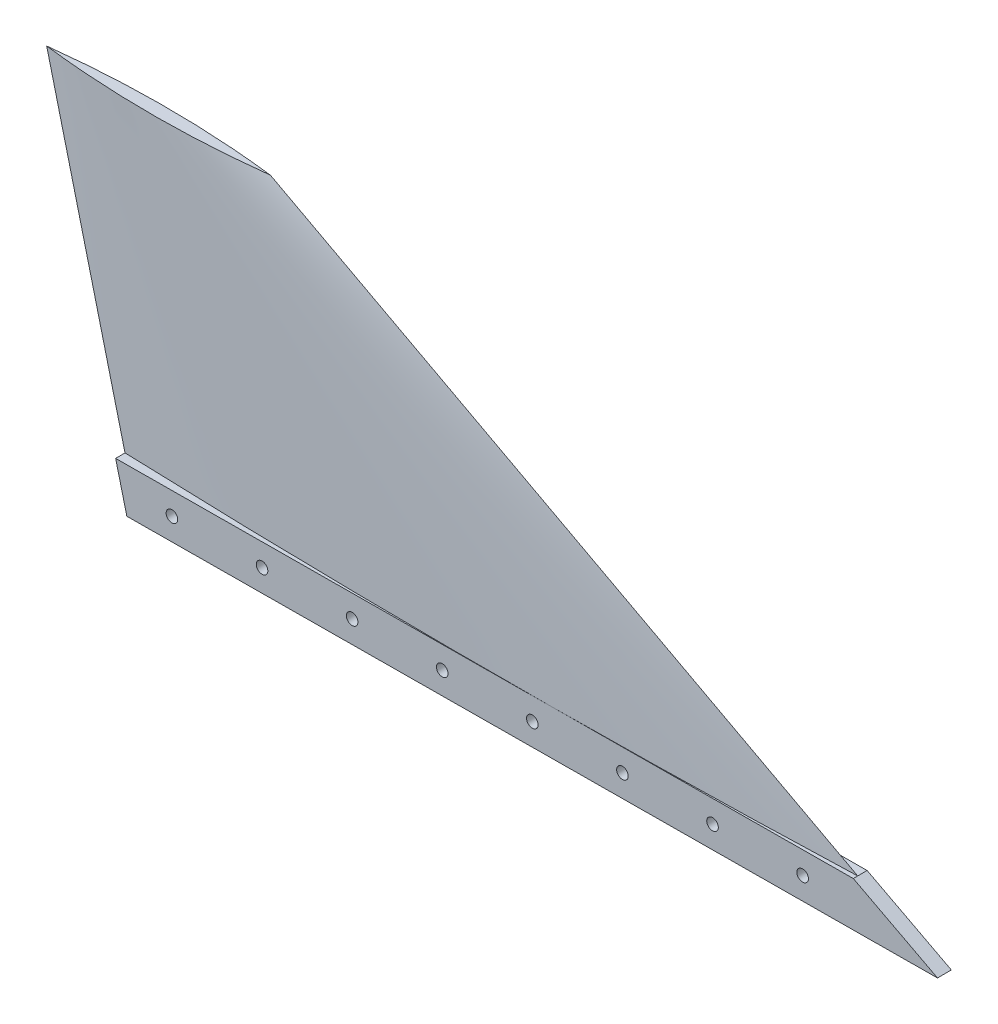
ISO-10303-21;
HEADER;
FILE_DESCRIPTION(('STEP AP214'),'2;1');
FILE_NAME('part.step','',(''),(''),'','','');
FILE_SCHEMA(('AUTOMOTIVE_DESIGN { 1 0 10303 214 1 1 1 1 }'));
ENDSEC;
DATA;
#1=APPLICATION_CONTEXT('core data for automotive mechanical design processes');
#2=APPLICATION_PROTOCOL_DEFINITION('international standard','automotive_design',2000,#1);
#3=PRODUCT_CONTEXT('',#1,'mechanical');
#4=PRODUCT('Part','Part','',(#3));
#5=PRODUCT_RELATED_PRODUCT_CATEGORY('part','',(#4));
#6=PRODUCT_DEFINITION_FORMATION('','',#4);
#7=PRODUCT_DEFINITION_CONTEXT('part definition',#1,'design');
#8=PRODUCT_DEFINITION('design','',#6,#7);
#9=PRODUCT_DEFINITION_SHAPE('','',#8);
#10=(LENGTH_UNIT() NAMED_UNIT(*) SI_UNIT(.MILLI.,.METRE.));
#11=(NAMED_UNIT(*) PLANE_ANGLE_UNIT() SI_UNIT($,.RADIAN.));
#12=(NAMED_UNIT(*) SI_UNIT($,.STERADIAN.) SOLID_ANGLE_UNIT());
#13=UNCERTAINTY_MEASURE_WITH_UNIT(LENGTH_MEASURE(1.E-05),#10,'distance_accuracy_value','');
#14=(GEOMETRIC_REPRESENTATION_CONTEXT(3) GLOBAL_UNCERTAINTY_ASSIGNED_CONTEXT((#13)) GLOBAL_UNIT_ASSIGNED_CONTEXT((#10,
#11,#12)) REPRESENTATION_CONTEXT('',''));
#15=CARTESIAN_POINT('',(0.,0.,0.));
#16=DIRECTION('',(0.,0.,1.));
#17=DIRECTION('',(1.,0.,0.));
#18=AXIS2_PLACEMENT_3D('',#15,#16,#17);
#19=CARTESIAN_POINT('',(0.0361687419159977,0.,5.31354937671676));
#20=DIRECTION('',(0.00680673152056179,0.,0.99997683393467));
#21=DIRECTION('',(0.99997683393467,0.,-0.00680673152056179));
#22=AXIS2_PLACEMENT_3D('',#19,#20,#21);
#23=PLANE('',#22);
#24=DIRECTION('',(-0.99997683393467,0.,0.00680673152056179));
#25=VECTOR('',#24,1.);
#26=CARTESIAN_POINT('',(0.0171196245328655,0.0762000000009213,5.31367904194833));
#27=LINE('',#26,#25);
#28=CARTESIAN_POINT('',(457.072117556768,0.0762000000010352,2.20255630842018));
#29=VERTEX_POINT('',#28);
#30=CARTESIAN_POINT('',(0.0171196245328655,0.0762000000009213,5.31367904194833));
#31=VERTEX_POINT('',#30);
#32=EDGE_CURVE('E104',#29,#31,#27,.T.);
#33=ORIENTED_EDGE('',*,*,#32,.F.);
#34=DIRECTION('',(-0.882327973864772,0.470596722890842,0.00600590876445357));
#35=VECTOR('',#34,1.);
#36=CARTESIAN_POINT('',(409.592192479307,25.3999999999999,2.52574689809315));
#37=LINE('',#36,#35);
#38=CARTESIAN_POINT('',(409.592192479307,25.3999999999999,2.52574689809315));
#39=VERTEX_POINT('',#38);
#40=EDGE_CURVE('E315',#29,#39,#37,.T.);
#41=ORIENTED_EDGE('',*,*,#40,.T.);
#42=DIRECTION('',(-0.99997683393467,0.,0.00680673152056181));
#43=VECTOR('',#42,1.);
#44=CARTESIAN_POINT('',(-6.31353705246148,25.3999999999999,5.35677112057139));
#45=LINE('',#44,#43);
#46=CARTESIAN_POINT('',(240.236539544937,25.3999952591514,3.67853206460334));
#47=VERTEX_POINT('',#46);
#48=EDGE_CURVE('E127',#39,#47,#45,.T.);
#49=ORIENTED_EDGE('',*,*,#48,.T.);
#50=CARTESIAN_POINT('',(-6.31353705246148,25.3999999999999,5.35677112057139));
#51=VERTEX_POINT('',#50);
#52=EDGE_CURVE('E64',#47,#51,#45,.T.);
#53=ORIENTED_EDGE('',*,*,#52,.T.);
#54=DIRECTION('',(0.242524718461399,-0.970143822155345,-0.00165083888910814));
#55=VECTOR('',#54,1.);
#56=CARTESIAN_POINT('',(0.0361687419160004,9.20097331658098E-13,5.31354937671676));
#57=LINE('',#56,#55);
#58=EDGE_CURVE('E118',#51,#31,#57,.T.);
#59=ORIENTED_EDGE('',*,*,#58,.T.);
#60=EDGE_LOOP('',(#33,#41,#49,#53,#59));
#61=FACE_BOUND('',#60,.T.);
#62=CARTESIAN_POINT('',(381.019104809033,12.7,2.72024074023525));
#63=DIRECTION('',(0.00680673152056179,0.,0.99997683393467));
#64=DIRECTION('',(0.99997683393467,0.,-0.00680673152056179));
#65=AXIS2_PLACEMENT_3D('',#62,#63,#64);
#66=CIRCLE('',#65,3.26389999999999);
#67=CARTESIAN_POINT('',(384.282929197312,12.7,2.69802424922529));
#68=VERTEX_POINT('',#67);
#69=EDGE_CURVE('E281',#68,#68,#66,.T.);
#70=ORIENTED_EDGE('',*,*,#69,.F.);
#71=EDGE_LOOP('',(#70));
#72=FACE_BOUND('',#71,.T.);
#73=CARTESIAN_POINT('',(330.221458454008,12.7,3.06601469107229));
#74=DIRECTION('',(0.00680673152056179,0.,0.99997683393467));
#75=DIRECTION('',(0.99997683393467,0.,-0.00680673152056179));
#76=AXIS2_PLACEMENT_3D('',#73,#74,#75);
#77=CIRCLE('',#76,3.26389999999999);
#78=CARTESIAN_POINT('',(333.485282842287,12.7,3.04379820006233));
#79=VERTEX_POINT('',#78);
#80=EDGE_CURVE('E277',#79,#79,#77,.T.);
#81=ORIENTED_EDGE('',*,*,#80,.F.);
#82=EDGE_LOOP('',(#81));
#83=FACE_BOUND('',#82,.T.);
#84=CARTESIAN_POINT('',(279.423812098982,12.7,3.41178864190932));
#85=DIRECTION('',(0.00680673152056179,0.,0.99997683393467));
#86=DIRECTION('',(0.99997683393467,0.,-0.00680673152056179));
#87=AXIS2_PLACEMENT_3D('',#84,#85,#86);
#88=CIRCLE('',#87,3.26389999999999);
#89=CARTESIAN_POINT('',(282.687636487262,12.7,3.38957215089936));
#90=VERTEX_POINT('',#89);
#91=EDGE_CURVE('E272',#90,#90,#88,.T.);
#92=ORIENTED_EDGE('',*,*,#91,.F.);
#93=EDGE_LOOP('',(#92));
#94=FACE_BOUND('',#93,.T.);
#95=CARTESIAN_POINT('',(228.626165743957,12.7,3.75756259274635));
#96=DIRECTION('',(0.00680673152056179,0.,0.99997683393467));
#97=DIRECTION('',(0.99997683393467,0.,-0.00680673152056179));
#98=AXIS2_PLACEMENT_3D('',#95,#96,#97);
#99=CIRCLE('',#98,3.26389999999999);
#100=CARTESIAN_POINT('',(231.889990132237,12.7,3.73534610173639));
#101=VERTEX_POINT('',#100);
#102=EDGE_CURVE('E267',#101,#101,#99,.T.);
#103=ORIENTED_EDGE('',*,*,#102,.F.);
#104=EDGE_LOOP('',(#103));
#105=FACE_BOUND('',#104,.T.);
#106=CARTESIAN_POINT('',(177.828519388932,12.7,4.10333654358339));
#107=DIRECTION('',(0.00680673152056179,0.,0.99997683393467));
#108=DIRECTION('',(0.99997683393467,0.,-0.00680673152056179));
#109=AXIS2_PLACEMENT_3D('',#106,#107,#108);
#110=CIRCLE('',#109,3.26389999999999);
#111=CARTESIAN_POINT('',(181.092343777211,12.7,4.08112005257343));
#112=VERTEX_POINT('',#111);
#113=EDGE_CURVE('E262',#112,#112,#110,.T.);
#114=ORIENTED_EDGE('',*,*,#113,.F.);
#115=EDGE_LOOP('',(#114));
#116=FACE_BOUND('',#115,.T.);
#117=CARTESIAN_POINT('',(127.030873033907,12.7,4.44911049442043));
#118=DIRECTION('',(0.00680673152056179,0.,0.99997683393467));
#119=DIRECTION('',(0.99997683393467,0.,-0.00680673152056179));
#120=AXIS2_PLACEMENT_3D('',#117,#118,#119);
#121=CIRCLE('',#120,3.26389999999999);
#122=CARTESIAN_POINT('',(130.294697422186,12.7,4.42689400341046));
#123=VERTEX_POINT('',#122);
#124=EDGE_CURVE('E257',#123,#123,#121,.T.);
#125=ORIENTED_EDGE('',*,*,#124,.F.);
#126=EDGE_LOOP('',(#125));
#127=FACE_BOUND('',#126,.T.);
#128=CARTESIAN_POINT('',(76.2332266788818,12.7,4.79488444525746));
#129=DIRECTION('',(0.00680673152056179,0.,0.99997683393467));
#130=DIRECTION('',(0.99997683393467,0.,-0.00680673152056179));
#131=AXIS2_PLACEMENT_3D('',#128,#129,#130);
#132=CIRCLE('',#131,3.26389999999999);
#133=CARTESIAN_POINT('',(79.4970510671611,12.7,4.7726679542475));
#134=VERTEX_POINT('',#133);
#135=EDGE_CURVE('E252',#134,#134,#132,.T.);
#136=ORIENTED_EDGE('',*,*,#135,.F.);
#137=EDGE_LOOP('',(#136));
#138=FACE_BOUND('',#137,.T.);
#139=CARTESIAN_POINT('',(25.4355803238566,12.7,5.14065839609449));
#140=DIRECTION('',(0.00680673152056179,0.,0.99997683393467));
#141=DIRECTION('',(0.99997683393467,0.,-0.00680673152056179));
#142=AXIS2_PLACEMENT_3D('',#139,#140,#141);
#143=CIRCLE('',#142,3.26389999999999);
#144=CARTESIAN_POINT('',(28.699404712136,12.7,5.11844190508453));
#145=VERTEX_POINT('',#144);
#146=EDGE_CURVE('E140',#145,#145,#143,.T.);
#147=ORIENTED_EDGE('',*,*,#146,.F.);
#148=EDGE_LOOP('',(#147));
#149=FACE_BOUND('',#148,.T.);
#150=ADVANCED_FACE('F40',(#61,#72,#83,#94,#105,#116,#127,#138,#149),#23,.T.);
#151=CARTESIAN_POINT('',(409.592192479307,25.3999999999999,2.52574689809315));
#152=DIRECTION('',(-0.470585821016415,-0.882348414405783,0.00320322554717418));
#153=DIRECTION('',(0.882352941176471,-0.470588235294116,0.));
#154=AXIS2_PLACEMENT_3D('',#151,#152,#153);
#155=PLANE('',#154);
#156=ORIENTED_EDGE('',*,*,#40,.F.);
#157=DIRECTION('',(-0.00680673152056182,0.,-0.99997683393467));
#158=VECTOR('',#157,1.);
#159=CARTESIAN_POINT('',(457.072117556768,0.0762000000009214,2.20255630842017));
#160=LINE('',#159,#158);
#161=CARTESIAN_POINT('',(457.018462130699,0.0762000000009069,-5.67996159642469));
#162=VERTEX_POINT('',#161);
#163=EDGE_CURVE('E107',#29,#162,#160,.T.);
#164=ORIENTED_EDGE('',*,*,#163,.T.);
#165=DIRECTION('',(-0.882327973864772,0.470596722890842,0.00600590876445357));
#166=VECTOR('',#165,1.);
#167=CARTESIAN_POINT('',(409.538537053238,25.3999999999999,-5.35677100675171));
#168=LINE('',#167,#166);
#169=CARTESIAN_POINT('',(409.538537053238,25.3999999999999,-5.35677100675171));
#170=VERTEX_POINT('',#169);
#171=EDGE_CURVE('E136',#162,#170,#168,.T.);
#172=ORIENTED_EDGE('',*,*,#171,.T.);
#173=DIRECTION('',(-0.00680673152056181,0.,-0.99997683393467));
#174=VECTOR('',#173,1.);
#175=CARTESIAN_POINT('',(409.592192479307,25.3999999999999,2.52574689809315));
#176=LINE('',#175,#174);
#177=CARTESIAN_POINT('',(409.575000000001,25.3999999999999,0.));
#178=VERTEX_POINT('',#177);
#179=EDGE_CURVE('E324',#178,#170,#176,.T.);
#180=ORIENTED_EDGE('',*,*,#179,.F.);
#181=EDGE_CURVE('E153',#39,#178,#176,.T.);
#182=ORIENTED_EDGE('',*,*,#181,.F.);
#183=EDGE_LOOP('',(#156,#164,#172,#180,#182));
#184=FACE_BOUND('',#183,.T.);
#185=ADVANCED_FACE('F179',(#184),#155,.F.);
#186=CARTESIAN_POINT('',(-6.31353705246148,25.3999999999999,5.35677112057139));
#187=DIRECTION('',(0.,-1.,0.));
#188=DIRECTION('',(0.,0.,-1.));
#189=AXIS2_PLACEMENT_3D('',#186,#187,#188);
#190=PLANE('',#189);
#191=CARTESIAN_POINT('',(409.575000000002,25.3999999999999,0.));
#192=CARTESIAN_POINT('',(396.5606245819,25.3999999999999,-0.476916610177097));
#193=CARTESIAN_POINT('',(383.544656897739,25.3999999999999,-0.90907498505507));
#194=CARTESIAN_POINT('',(357.510043009885,25.3999999999999,-1.68386694266647));
#195=CARTESIAN_POINT('',(344.491396803277,25.3999999999999,-2.02650042749993));
#196=CARTESIAN_POINT('',(305.43262135354,25.3999999999999,-2.9200909707166));
#197=CARTESIAN_POINT('',(279.389276173742,25.3999999999999,-3.33675200968741));
#198=CARTESIAN_POINT('',(231.705765832347,25.3999999999999,-3.77142761086389));
#199=CARTESIAN_POINT('',(210.066072612343,25.3999999999999,-3.84495913444976));
#200=CARTESIAN_POINT('',(166.787265614521,25.3999999999999,-3.74439215996127));
#201=CARTESIAN_POINT('',(145.148151835605,25.4,-3.57029417091872));
#202=CARTESIAN_POINT('',(101.862013548756,25.4,-2.97462092692077));
#203=CARTESIAN_POINT('',(80.2149908283904,25.3999999999999,-2.55291618903659));
#204=CARTESIAN_POINT('',(36.9271362679637,25.3999999999999,-1.46203495928207));
#205=CARTESIAN_POINT('',(15.286304441001,25.3999999999999,-0.792857947625323));
#206=CARTESIAN_POINT('',(-6.34999999999872,25.4,0.));
#207=B_SPLINE_CURVE_WITH_KNOTS('',3,(#191,#192,#193,#194,#195,#196,#197,#198,#199,#200,#201,
#202,#203,#204,#205,#206),.UNSPECIFIED.,.F.,.F.,(4,2,2,2,2,2,2,4),(0.,39.0691598923866,
78.1383625086864,156.275629753643,221.193764665568,286.111766130766,351.063745946092,
416.015862186186),.UNSPECIFIED.);
#208=CARTESIAN_POINT('',(163.017578582288,25.3999999999999,-3.67873015464439));
#209=VERTEX_POINT('',#208);
#210=EDGE_CURVE('E189',#178,#209,#207,.T.);
#211=ORIENTED_EDGE('',*,*,#210,.F.);
#212=ORIENTED_EDGE('',*,*,#179,.T.);
#213=DIRECTION('',(-0.99997683393467,0.,0.00680673152056181));
#214=VECTOR('',#213,1.);
#215=CARTESIAN_POINT('',(-6.36719247853088,25.3999999999999,-2.52574678427348));
#216=LINE('',#215,#214);
#217=EDGE_CURVE('E145',#170,#209,#216,.T.);
#218=ORIENTED_EDGE('',*,*,#217,.T.);
#219=EDGE_LOOP('',(#211,#212,#218));
#220=FACE_BOUND('',#219,.T.);
#221=ADVANCED_FACE('F176',(#220),#190,.F.);
#222=CARTESIAN_POINT('',(-6.3499999999997,25.3999999999999,0.));
#223=CARTESIAN_POINT('',(7.31425090283398,25.3999999999999,0.500731518217575));
#224=CARTESIAN_POINT('',(20.980251990129,25.3999999999999,0.952123050195042));
#225=CARTESIAN_POINT('',(48.3151798363333,25.3999999999999,1.7562167474739));
#226=CARTESIAN_POINT('',(61.9841066000349,25.3999999999999,2.10891874985605));
#227=CARTESIAN_POINT('',(102.993810017454,25.3999999999999,3.01896224900369));
#228=CARTESIAN_POINT('',(130.338045274505,25.4,3.42826085952696));
#229=CARTESIAN_POINT('',(178.672798947498,25.3999999999999,3.80242123369392));
#230=CARTESIAN_POINT('',(199.66275311495,25.3999999999999,3.84847649355824));
#231=CARTESIAN_POINT('',(241.641870080202,25.3999999999999,3.70762258713574));
#232=CARTESIAN_POINT('',(262.631032880047,25.4,3.52071407125534));
#233=CARTESIAN_POINT('',(304.616317989458,25.4,2.91406830899902));
#234=CARTESIAN_POINT('',(325.61243863678,25.3999999999999,2.4942164610373));
#235=CARTESIAN_POINT('',(367.598792192431,25.3999999999999,1.42169703584682));
#236=CARTESIAN_POINT('',(388.589025083953,25.3999999999999,0.769028800708385));
#237=CARTESIAN_POINT('',(409.575,25.4,0.));
#238=B_SPLINE_CURVE_WITH_KNOTS('',3,(#222,#223,#224,#225,#226,#227,#228,#229,#230,#231,#232,
#233,#234,#235,#236,#237),.UNSPECIFIED.,.F.,.F.,(4,2,2,2,2,2,2,4),(0.,41.0200628998691,
82.0401935163243,164.078847388457,227.047685887877,290.01634858638,353.01601760556,
416.015864655249),.UNSPECIFIED.);
#239=EDGE_CURVE('E163',#47,#178,#238,.T.);
#240=ORIENTED_EDGE('',*,*,#239,.F.);
#241=ORIENTED_EDGE('',*,*,#48,.F.);
#242=ORIENTED_EDGE('',*,*,#181,.T.);
#243=EDGE_LOOP('',(#240,#241,#242));
#244=FACE_BOUND('',#243,.T.);
#245=ADVANCED_FACE('F330',(#244),#190,.F.);
#246=CARTESIAN_POINT('',(-6.34999999999904,25.4,0.));
#247=VERTEX_POINT('',#246);
#248=EDGE_CURVE('E154',#247,#47,#238,.T.);
#249=ORIENTED_EDGE('',*,*,#248,.F.);
#250=DIRECTION('',(-0.00680673152056181,0.,-0.99997683393467));
#251=VECTOR('',#250,1.);
#252=CARTESIAN_POINT('',(-6.31353705246148,25.3999999999999,5.35677112057139));
#253=LINE('',#252,#251);
#254=EDGE_CURVE('E131',#51,#247,#253,.T.);
#255=ORIENTED_EDGE('',*,*,#254,.F.);
#256=ORIENTED_EDGE('',*,*,#52,.F.);
#257=EDGE_LOOP('',(#249,#255,#256));
#258=FACE_BOUND('',#257,.T.);
#259=ADVANCED_FACE('F177',(#258),#190,.F.);
#260=CARTESIAN_POINT('',(0.0361687419160004,9.20097331658098E-13,5.31354937671676));
#261=DIRECTION('',(0.970121347740181,0.242530336935029,-0.00660350853374309));
#262=DIRECTION('',(-0.242535625036318,0.970142500145336,0.));
#263=AXIS2_PLACEMENT_3D('',#260,#261,#262);
#264=PLANE('',#263);
#265=DIRECTION('',(0.242524718461399,-0.970143822155345,-0.00165083888910814));
#266=VECTOR('',#265,1.);
#267=CARTESIAN_POINT('',(-0.0174866841534056,9.20097331658098E-13,-2.56896852812811));
#268=LINE('',#267,#266);
#269=CARTESIAN_POINT('',(-6.36719247853088,25.3999999999999,-2.52574678427348));
#270=VERTEX_POINT('',#269);
#271=CARTESIAN_POINT('',(-0.0365358015365391,0.0762000000009214,-2.56883886289654));
#272=VERTEX_POINT('',#271);
#273=EDGE_CURVE('E120',#270,#272,#268,.T.);
#274=ORIENTED_EDGE('',*,*,#273,.T.);
#275=DIRECTION('',(0.00680673152056179,0.,0.99997683393467));
#276=VECTOR('',#275,1.);
#277=CARTESIAN_POINT('',(-0.0610759584673629,0.0762000000009214,-6.17403297960506));
#278=LINE('',#277,#276);
#279=EDGE_CURVE('E57',#272,#31,#278,.T.);
#280=ORIENTED_EDGE('',*,*,#279,.T.);
#281=ORIENTED_EDGE('',*,*,#58,.F.);
#282=ORIENTED_EDGE('',*,*,#254,.T.);
#283=EDGE_CURVE('E126',#247,#270,#253,.T.);
#284=ORIENTED_EDGE('',*,*,#283,.T.);
#285=EDGE_LOOP('',(#274,#280,#281,#282,#284));
#286=FACE_BOUND('',#285,.T.);
#287=ADVANCED_FACE('F116',(#286),#264,.F.);
#288=CARTESIAN_POINT('',(162.959355266017,25.3999999999999,-3.67833383498113));
#289=VERTEX_POINT('',#288);
#290=EDGE_CURVE('E50',#289,#247,#207,.T.);
#291=ORIENTED_EDGE('',*,*,#290,.F.);
#292=EDGE_CURVE('E139',#289,#270,#216,.T.);
#293=ORIENTED_EDGE('',*,*,#292,.T.);
#294=ORIENTED_EDGE('',*,*,#283,.F.);
#295=EDGE_LOOP('',(#291,#293,#294));
#296=FACE_BOUND('',#295,.T.);
#297=ADVANCED_FACE('F169',(#296),#190,.F.);
#298=CARTESIAN_POINT('',(-0.0174866841534083,0.,-2.56896852812811));
#299=DIRECTION('',(0.00680673152056179,0.,0.99997683393467));
#300=DIRECTION('',(0.99997683393467,0.,-0.00680673152056179));
#301=AXIS2_PLACEMENT_3D('',#298,#299,#300);
#302=PLANE('',#301);
#303=CARTESIAN_POINT('',(380.965449382963,12.7,-5.16227716460962));
#304=DIRECTION('',(0.00680673152056179,0.,0.99997683393467));
#305=DIRECTION('',(0.99997683393467,0.,-0.00680673152056179));
#306=AXIS2_PLACEMENT_3D('',#303,#304,#305);
#307=CIRCLE('',#306,3.26389999999999);
#308=CARTESIAN_POINT('',(384.229273771243,12.7,-5.18449365561958));
#309=VERTEX_POINT('',#308);
#310=EDGE_CURVE('E282',#309,#309,#307,.T.);
#311=ORIENTED_EDGE('',*,*,#310,.T.);
#312=EDGE_LOOP('',(#311));
#313=FACE_BOUND('',#312,.T.);
#314=CARTESIAN_POINT('',(330.167803027938,12.7,-4.81650321377258));
#315=DIRECTION('',(0.00680673152056179,0.,0.99997683393467));
#316=DIRECTION('',(0.99997683393467,0.,-0.00680673152056179));
#317=AXIS2_PLACEMENT_3D('',#314,#315,#316);
#318=CIRCLE('',#317,3.26389999999999);
#319=CARTESIAN_POINT('',(333.431627416217,12.7,-4.83871970478255));
#320=VERTEX_POINT('',#319);
#321=EDGE_CURVE('E278',#320,#320,#318,.T.);
#322=ORIENTED_EDGE('',*,*,#321,.T.);
#323=EDGE_LOOP('',(#322));
#324=FACE_BOUND('',#323,.T.);
#325=CARTESIAN_POINT('',(279.370156672913,12.7,-4.47072926293555));
#326=DIRECTION('',(0.00680673152056179,0.,0.99997683393467));
#327=DIRECTION('',(0.99997683393467,0.,-0.00680673152056179));
#328=AXIS2_PLACEMENT_3D('',#325,#326,#327);
#329=CIRCLE('',#328,3.26389999999999);
#330=CARTESIAN_POINT('',(282.633981061192,12.7,-4.49294575394551));
#331=VERTEX_POINT('',#330);
#332=EDGE_CURVE('E273',#331,#331,#329,.T.);
#333=ORIENTED_EDGE('',*,*,#332,.T.);
#334=EDGE_LOOP('',(#333));
#335=FACE_BOUND('',#334,.T.);
#336=CARTESIAN_POINT('',(228.572510317888,12.7,-4.12495531209851));
#337=DIRECTION('',(0.00680673152056179,0.,0.99997683393467));
#338=DIRECTION('',(0.99997683393467,0.,-0.00680673152056179));
#339=AXIS2_PLACEMENT_3D('',#336,#337,#338);
#340=CIRCLE('',#339,3.26389999999999);
#341=CARTESIAN_POINT('',(231.836334706167,12.7,-4.14717180310847));
#342=VERTEX_POINT('',#341);
#343=EDGE_CURVE('E268',#342,#342,#340,.T.);
#344=ORIENTED_EDGE('',*,*,#343,.T.);
#345=EDGE_LOOP('',(#344));
#346=FACE_BOUND('',#345,.T.);
#347=CARTESIAN_POINT('',(177.774863962863,12.7,-3.77918136126148));
#348=DIRECTION('',(0.00680673152056179,0.,0.99997683393467));
#349=DIRECTION('',(0.99997683393467,0.,-0.00680673152056179));
#350=AXIS2_PLACEMENT_3D('',#347,#348,#349);
#351=CIRCLE('',#350,3.26389999999999);
#352=CARTESIAN_POINT('',(181.038688351142,12.7,-3.80139785227144));
#353=VERTEX_POINT('',#352);
#354=EDGE_CURVE('E263',#353,#353,#351,.T.);
#355=ORIENTED_EDGE('',*,*,#354,.T.);
#356=EDGE_LOOP('',(#355));
#357=FACE_BOUND('',#356,.T.);
#358=CARTESIAN_POINT('',(126.977217607838,12.7,-3.43340741042444));
#359=DIRECTION('',(0.00680673152056179,0.,0.99997683393467));
#360=DIRECTION('',(0.99997683393467,0.,-0.00680673152056179));
#361=AXIS2_PLACEMENT_3D('',#358,#359,#360);
#362=CIRCLE('',#361,3.26389999999999);
#363=CARTESIAN_POINT('',(130.241041996117,12.7,-3.45562390143441));
#364=VERTEX_POINT('',#363);
#365=EDGE_CURVE('E258',#364,#364,#362,.T.);
#366=ORIENTED_EDGE('',*,*,#365,.T.);
#367=EDGE_LOOP('',(#366));
#368=FACE_BOUND('',#367,.T.);
#369=CARTESIAN_POINT('',(76.1795712528124,12.7,-3.08763345958741));
#370=DIRECTION('',(0.00680673152056179,0.,0.99997683393467));
#371=DIRECTION('',(0.99997683393467,0.,-0.00680673152056179));
#372=AXIS2_PLACEMENT_3D('',#369,#370,#371);
#373=CIRCLE('',#372,3.26389999999999);
#374=CARTESIAN_POINT('',(79.4433956410917,12.7,-3.10984995059737));
#375=VERTEX_POINT('',#374);
#376=EDGE_CURVE('E253',#375,#375,#373,.T.);
#377=ORIENTED_EDGE('',*,*,#376,.T.);
#378=EDGE_LOOP('',(#377));
#379=FACE_BOUND('',#378,.T.);
#380=CARTESIAN_POINT('',(25.3819248977872,12.7,-2.74185950875037));
#381=DIRECTION('',(0.00680673152056179,0.,0.99997683393467));
#382=DIRECTION('',(0.99997683393467,0.,-0.00680673152056179));
#383=AXIS2_PLACEMENT_3D('',#380,#381,#382);
#384=CIRCLE('',#383,3.26389999999999);
#385=CARTESIAN_POINT('',(28.6457492860666,12.7,-2.76407599976034));
#386=VERTEX_POINT('',#385);
#387=EDGE_CURVE('E248',#386,#386,#384,.T.);
#388=ORIENTED_EDGE('',*,*,#387,.T.);
#389=EDGE_LOOP('',(#388));
#390=FACE_BOUND('',#389,.T.);
#391=ORIENTED_EDGE('',*,*,#171,.F.);
#392=DIRECTION('',(-0.99997683393467,0.,0.00680673152056179));
#393=VECTOR('',#392,1.);
#394=CARTESIAN_POINT('',(-0.0174866841534083,0.0762000000009214,-2.56896852812811));
#395=LINE('',#394,#393);
#396=EDGE_CURVE('E11',#162,#272,#395,.T.);
#397=ORIENTED_EDGE('',*,*,#396,.T.);
#398=ORIENTED_EDGE('',*,*,#273,.F.);
#399=ORIENTED_EDGE('',*,*,#292,.F.);
#400=CARTESIAN_POINT('',(-38.4500355582179,223.52,-2.30736242590742));
#401=CARTESIAN_POINT('',(-37.4561830065711,221.843287650354,-2.31412747011696));
#402=CARTESIAN_POINT('',(-36.4575876536532,220.169384930391,-2.3209247980493));
#403=CARTESIAN_POINT('',(-34.4507233185757,216.827346745532,-2.33458530123647));
#404=CARTESIAN_POINT('',(-33.4424541571678,215.159211388284,-2.34144847771143));
#405=CARTESIAN_POINT('',(-31.4160815802042,211.828902601872,-2.3552417713398));
#406=CARTESIAN_POINT('',(-30.3979780726466,210.166729228684,-2.36217188911944));
#407=CARTESIAN_POINT('',(-28.3517676770293,206.848545509499,-2.37610021658154));
#408=CARTESIAN_POINT('',(-27.3236607651446,205.192535178194,-2.38309842642616));
#409=CARTESIAN_POINT('',(-25.2612442348789,201.89324508157,-2.39713706725131));
#410=CARTESIAN_POINT('',(-24.2269737580558,200.249940849821,-2.4041772317996));
#411=CARTESIAN_POINT('',(-22.1481482649186,196.969859395103,-2.41832756661707));
#412=CARTESIAN_POINT('',(-21.1035932897462,195.333082146061,-2.4254377366062));
#413=CARTESIAN_POINT('',(-19.0040071122817,192.066267551761,-2.43972938710179));
#414=CARTESIAN_POINT('',(-17.9489759450624,190.436230183965,-2.44691086736952));
#415=CARTESIAN_POINT('',(-15.8282374940846,187.183116521375,-2.46134649904744));
#416=CARTESIAN_POINT('',(-14.762530209225,185.560040227298,-2.46860065046513));
#417=CARTESIAN_POINT('',(-12.1580044926899,181.622231893473,-2.48632936846063));
#418=CARTESIAN_POINT('',(-10.6134762572256,179.311272438748,-2.49684280104022));
#419=CARTESIAN_POINT('',(-7.50147937866961,174.704804972482,-2.51802581901256));
#420=CARTESIAN_POINT('',(-5.93401041608751,172.409297176785,-2.52869540658003));
#421=CARTESIAN_POINT('',(-2.77544860172904,167.834489928809,-2.55019538691142));
#422=CARTESIAN_POINT('',(-1.18435506791634,165.555190947296,-2.56102578431788));
#423=CARTESIAN_POINT('',(2.02219191253174,161.013600162884,-2.58285239435853));
#424=CARTESIAN_POINT('',(3.637646702448,158.751309308198,-2.59384861613629));
#425=CARTESIAN_POINT('',(6.90199708370315,154.233113894445,-2.61606868752216));
#426=CARTESIAN_POINT('',(8.55102257481784,151.977303160073,-2.62729342134366));
#427=CARTESIAN_POINT('',(11.8751063756254,147.484979487221,-2.64992009149852));
#428=CARTESIAN_POINT('',(13.5501643901672,145.248466330395,-2.66132202582283));
#429=CARTESIAN_POINT('',(16.9270007171497,140.796044142942,-2.68430777657888));
#430=CARTESIAN_POINT('',(18.6287763661825,138.580133093174,-2.69589157488111));
#431=CARTESIAN_POINT('',(22.0598046821537,134.170289413592,-2.71924620450224));
#432=CARTESIAN_POINT('',(23.7890526623273,131.976353136841,-2.73101700391887));
#433=CARTESIAN_POINT('',(27.8966023199145,126.834911796001,-2.75897663936018));
#434=CARTESIAN_POINT('',(30.2869406565592,123.89700429405,-2.77524740759071));
#435=CARTESIAN_POINT('',(35.1227755235378,118.067255254275,-2.80816439976519));
#436=CARTESIAN_POINT('',(37.5682683038376,115.175410607244,-2.82481059818308));
#437=CARTESIAN_POINT('',(42.517946574869,109.44125718197,-2.85850250979618));
#438=CARTESIAN_POINT('',(45.0221446241364,106.598959233996,-2.87554830847594));
#439=CARTESIAN_POINT('',(50.0933574088046,100.967909183943,-2.91006749205848));
#440=CARTESIAN_POINT('',(52.6604078112711,98.1791891665278,-2.92754111974302));
#441=CARTESIAN_POINT('',(57.8622082787748,92.6600128001991,-2.96294919921473));
#442=CARTESIAN_POINT('',(60.4970268869493,89.9296209998732,-2.98088411756745));
#443=CARTESIAN_POINT('',(65.8403288678975,84.5326348521742,-3.01725538216414));
#444=CARTESIAN_POINT('',(68.5489282101149,81.8661549959263,-3.03569251779927));
#445=CARTESIAN_POINT('',(72.6549482130188,77.9363109999172,-3.06364174105063));
#446=CARTESIAN_POINT('',(74.0244852520572,76.6437298875748,-3.07296402794354));
#447=CARTESIAN_POINT('',(76.7823800767529,74.0788185259472,-3.09173671246642));
#448=CARTESIAN_POINT('',(78.1707375889225,72.8064879829758,-3.1011871082348));
#449=CARTESIAN_POINT('',(80.9675437941661,70.2829269391683,-3.12022465821406));
#450=CARTESIAN_POINT('',(82.3760005424089,69.0317053630308,-3.12981186725559));
#451=CARTESIAN_POINT('',(85.2131971162556,66.552459293658,-3.14912434999906));
#452=CARTESIAN_POINT('',(86.6419369391138,65.3244347972826,-3.15884962368231));
#453=CARTESIAN_POINT('',(89.5192439269398,62.894426205121,-3.17843513356988));
#454=CARTESIAN_POINT('',(90.9677924595716,61.6924200615824,-3.18829524294595));
#455=CARTESIAN_POINT('',(93.8868462126867,59.315344330455,-3.20816491843969));
#456=CARTESIAN_POINT('',(95.3573514717963,58.1402747902622,-3.21817448482029));
#457=CARTESIAN_POINT('',(98.3186911086269,55.8214396199678,-3.23833199563961));
#458=CARTESIAN_POINT('',(99.8094851976495,54.6776225834473,-3.24847966583762));
#459=CARTESIAN_POINT('',(102.81499837262,52.4218454423517,-3.26893786103704));
#460=CARTESIAN_POINT('',(104.329717346565,51.3098851887112,-3.27924838527607));
#461=CARTESIAN_POINT('',(107.381250730728,49.123154388574,-3.30001983494085));
#462=CARTESIAN_POINT('',(108.918015351389,48.0483144464516,-3.31048042145462));
#463=CARTESIAN_POINT('',(112.017926347325,45.9372380246423,-3.33158117216296));
#464=CARTESIAN_POINT('',(113.581073279264,44.9010023609853,-3.34222134014669));
#465=CARTESIAN_POINT('',(116.733621643332,42.8726979801655,-3.36368038758818));
#466=CARTESIAN_POINT('',(118.322995625641,41.8805866597995,-3.37449908019807));
#467=CARTESIAN_POINT('',(121.531067255941,39.9450123042656,-3.39633606836134));
#468=CARTESIAN_POINT('',(123.149762935684,39.0015460199831,-3.40735435051709));
#469=CARTESIAN_POINT('',(125.766135608915,37.5356264596605,-3.42516370943428));
#470=CARTESIAN_POINT('',(126.753878197425,36.9954010956939,-3.43188716380168));
#471=CARTESIAN_POINT('',(128.741037032571,35.9368900195158,-3.44541353383399));
#472=CARTESIAN_POINT('',(129.740452920627,35.4186036356365,-3.45221644705811));
#473=CARTESIAN_POINT('',(131.751859327398,34.4058699223466,-3.46590786762408));
#474=CARTESIAN_POINT('',(132.763855188229,33.9114331882045,-3.47279641132913));
#475=CARTESIAN_POINT('',(134.800439003407,32.9491764753103,-3.48665921172471));
#476=CARTESIAN_POINT('',(135.825026854172,32.4813562777876,-3.49363346771017));
#477=CARTESIAN_POINT('',(137.885740457439,31.5760136949324,-3.50766051689991));
#478=CARTESIAN_POINT('',(138.921847079265,31.138447870355,-3.51471317988381));
#479=CARTESIAN_POINT('',(141.007559155865,30.2964694739562,-3.52891039091194));
#480=CARTESIAN_POINT('',(142.057165371134,29.8920587794621,-3.53605494413277));
#481=CARTESIAN_POINT('',(144.169528333968,29.1211019960324,-3.55043356479082));
#482=CARTESIAN_POINT('',(145.232276830972,28.7545333796247,-3.55766757606739));
#483=CARTESIAN_POINT('',(147.371588799511,28.0645355064024,-3.57222963562158));
#484=CARTESIAN_POINT('',(148.448149643515,27.7410981742671,-3.5795576660139));
#485=CARTESIAN_POINT('',(150.261515563298,27.2416780767573,-3.59190104692597));
#486=CARTESIAN_POINT('',(150.994561624002,27.0520174671409,-3.59689081024657));
#487=CARTESIAN_POINT('',(152.466793253699,26.698054266856,-3.60691212784049));
#488=CARTESIAN_POINT('',(153.205978829922,26.5337517060484,-3.61194368216303));
#489=CARTESIAN_POINT('',(154.690365317262,26.2335686934808,-3.62204773652629));
#490=CARTESIAN_POINT('',(155.435567943601,26.0976966662231,-3.62712024824233));
#491=CARTESIAN_POINT('',(156.930465019495,25.8582842730783,-3.6372958470174));
#492=CARTESIAN_POINT('',(157.68015440855,25.7547126610535,-3.64239889963016));
#493=CARTESIAN_POINT('',(159.183607757155,25.5842242666563,-3.65263274000562));
#494=CARTESIAN_POINT('',(159.937370854919,25.517300016241,-3.65776352190224));
#495=CARTESIAN_POINT('',(161.44718533992,25.4255098899655,-3.66804066182839));
#496=CARTESIAN_POINT('',(162.203235348984,25.4006223747105,-3.67318701047685));
#497=CARTESIAN_POINT('',(163.638193330565,25.3994412372499,-3.68295461047762));
#498=CARTESIAN_POINT('',(164.317087743008,25.418440897212,-3.68757576952801));
#499=CARTESIAN_POINT('',(165.672315913036,25.5011509023545,-3.69680065753485));
#500=CARTESIAN_POINT('',(166.348649458503,25.5648648731725,-3.70140438504744));
#501=CARTESIAN_POINT('',(167.693424790288,25.7432786288452,-3.71055812174244));
#502=CARTESIAN_POINT('',(168.36188010141,25.8578717235322,-3.71510822298668));
#503=CARTESIAN_POINT('',(169.35489375073,26.0731599878901,-3.72186755688103));
#504=CARTESIAN_POINT('',(169.684231504862,26.1521387098607,-3.72410932248588));
#505=CARTESIAN_POINT('',(170.338929256862,26.3254955209087,-3.72856577754939));
#506=CARTESIAN_POINT('',(170.664288360887,26.4198770044459,-3.73078046092376));
#507=CARTESIAN_POINT('',(171.418063921298,26.6592745383565,-3.73591132765223));
#508=CARTESIAN_POINT('',(171.844484425909,26.8106604675391,-3.73881392478373));
#509=CARTESIAN_POINT('',(172.684974631417,27.1443142487257,-3.74453504849421));
#510=CARTESIAN_POINT('',(173.099048226877,27.32657223899,-3.74735360158305));
#511=CARTESIAN_POINT('',(173.911130676848,27.7233821680881,-3.7528813568489));
#512=CARTESIAN_POINT('',(174.309150737832,27.9379110669001,-3.75559063530714));
#513=CARTESIAN_POINT('',(175.085503739844,28.4002610307244,-3.76087518417922));
#514=CARTESIAN_POINT('',(175.463836648324,28.6480821507728,-3.76345045437152));
#515=CARTESIAN_POINT('',(176.076562766577,29.0902404490438,-3.76762121317417));
#516=CARTESIAN_POINT('',(176.317530192279,29.2755263897767,-3.76926145174399));
#517=CARTESIAN_POINT('',(176.787469205668,29.6607965553615,-3.77246027454331));
#518=CARTESIAN_POINT('',(177.01644022556,29.8607814748479,-3.77401885490788));
#519=CARTESIAN_POINT('',(177.461207755634,30.2748834604078,-3.77704633820903));
#520=CARTESIAN_POINT('',(177.677004845282,30.4889999040306,-3.77851524508998));
#521=CARTESIAN_POINT('',(178.094419394552,30.9305704090125,-3.78135653968125));
#522=CARTESIAN_POINT('',(178.296039184108,31.1580222674738,-3.78272894325118));
#523=CARTESIAN_POINT('',(178.684356078228,31.6253438284803,-3.7853721733276));
#524=CARTESIAN_POINT('',(178.871052527773,31.8652140753365,-3.78664299537544));
#525=CARTESIAN_POINT('',(179.228925231344,32.3561983143781,-3.78907899521971));
#526=CARTESIAN_POINT('',(179.40010329683,32.6073109891104,-3.79024418534656));
#527=CARTESIAN_POINT('',(179.781105575397,33.2050474347148,-3.7928376256453));
#528=CARTESIAN_POINT('',(179.984789123439,33.5556040387724,-3.79422407699059));
#529=CARTESIAN_POINT('',(180.363893518164,34.2715519668001,-3.79680459860428));
#530=CARTESIAN_POINT('',(180.539317419425,34.6369416821111,-3.79799868966485));
#531=CARTESIAN_POINT('',(180.86258823972,35.3798341910907,-3.80019915832323));
#532=CARTESIAN_POINT('',(181.010425873325,35.7573410133995,-3.80120547271616));
#533=CARTESIAN_POINT('',(181.279551249256,36.5216900741653,-3.80303737933356));
#534=CARTESIAN_POINT('',(181.400834831219,36.9085337649523,-3.8038629432389));
#535=CARTESIAN_POINT('',(181.680335901736,37.9120750060564,-3.80576547605982));
#536=CARTESIAN_POINT('',(181.820125671651,38.5339473644075,-3.80671700953624));
#537=CARTESIAN_POINT('',(182.044124815596,39.7878807957801,-3.80824174689207));
#538=CARTESIAN_POINT('',(182.128282552604,40.419950778355,-3.808814599284));
#539=CARTESIAN_POINT('',(182.247597339736,41.6900243131213,-3.80962676182105));
#540=CARTESIAN_POINT('',(182.28264114508,42.3280381748751,-3.8098653011215));
#541=CARTESIAN_POINT('',(182.309513716096,43.6046097033564,-3.81004821973518));
#542=CARTESIAN_POINT('',(182.301356873545,44.2431671181348,-3.80999269701164));
#543=CARTESIAN_POINT('',(182.241552125636,45.655172331747,-3.80958561271842));
#544=CARTESIAN_POINT('',(182.180966786037,46.4282298042988,-3.80917321502406));
#545=CARTESIAN_POINT('',(182.012458444214,47.9695470913792,-3.80802619741041));
#546=CARTESIAN_POINT('',(181.904501249145,48.7378030331785,-3.80729134474422));
#547=CARTESIAN_POINT('',(181.648001508218,50.2676492812965,-3.80554537942549));
#548=CARTESIAN_POINT('',(181.499446892632,51.0292375356894,-3.80453418461565));
#549=CARTESIAN_POINT('',(181.166980084079,52.5462489842427,-3.80227111988402));
#550=CARTESIAN_POINT('',(180.982994564143,53.301655945594,-3.80101875083369));
#551=CARTESIAN_POINT('',(180.584526019954,54.8039788427556,-3.79830641959996));
#552=CARTESIAN_POINT('',(180.370056157743,55.5508982936379,-3.79684654700914));
#553=CARTESIAN_POINT('',(179.914335573675,57.0364047417239,-3.79374450748294));
#554=CARTESIAN_POINT('',(179.673087433813,57.7749925347248,-3.79210235812293));
#555=CARTESIAN_POINT('',(179.1956217486,59.1606152250865,-3.78885230210239));
#556=CARTESIAN_POINT('',(178.96193991753,59.808528435765,-3.78726165576805));
#557=CARTESIAN_POINT('',(178.47776245541,61.0980654766618,-3.78396591342571));
#558=CARTESIAN_POINT('',(178.227266019565,61.7396890041515,-3.78226081193956));
#559=CARTESIAN_POINT('',(177.710857480611,63.017209001841,-3.77874567622811));
#560=CARTESIAN_POINT('',(177.444934758213,63.6531011702183,-3.77693556971848));
#561=CARTESIAN_POINT('',(176.899174862791,64.9189032517315,-3.77322064257541));
#562=CARTESIAN_POINT('',(176.619337183319,65.5488129461342,-3.77131581849463));
#563=CARTESIAN_POINT('',(176.046607632306,66.8035241359467,-3.76741731189393));
#564=CARTESIAN_POINT('',(175.753701351162,67.4283190465077,-3.76542353128945));
#565=CARTESIAN_POINT('',(175.156149765311,68.6722764372828,-3.76135606384766));
#566=CARTESIAN_POINT('',(174.851504153872,69.2914387698021,-3.75928237492246));
#567=CARTESIAN_POINT('',(173.920878440433,71.1416837602215,-3.75294770879566));
#568=CARTESIAN_POINT('',(173.278629154926,72.3646115217581,-3.7485759890644));
#569=CARTESIAN_POINT('',(171.956963683178,74.7899314699435,-3.73957955862632));
#570=CARTESIAN_POINT('',(171.277551599193,75.9923259040356,-3.7349548758431));
#571=CARTESIAN_POINT('',(169.882396753703,78.384688523341,-3.72545821137989));
#572=CARTESIAN_POINT('',(169.166474691874,79.5745519616938,-3.72058500922246));
#573=CARTESIAN_POINT('',(167.706366960418,81.935233987155,-3.71064621766064));
#574=CARTESIAN_POINT('',(166.962208300162,83.1060693165685,-3.70558081210607));
#575=CARTESIAN_POINT('',(165.448585373596,85.4303640215344,-3.69527774854012));
#576=CARTESIAN_POINT('',(164.679134607862,86.5838322029567,-3.69004018242568));
#577=CARTESIAN_POINT('',(163.117413131528,88.8747398128168,-3.67940971736033));
#578=CARTESIAN_POINT('',(162.325148629688,90.0121834791496,-3.67401686067176));
#579=CARTESIAN_POINT('',(160.719922011569,92.2721358942331,-3.66309026092624));
#580=CARTESIAN_POINT('',(159.906962463969,93.3946464704058,-3.657556535354));
#581=CARTESIAN_POINT('',(157.886205627954,96.1356615772582,-3.64380146745211));
#582=CARTESIAN_POINT('',(156.667790063801,97.746344150014,-3.63550784769591));
#583=CARTESIAN_POINT('',(154.195653514457,100.940446759029,-3.61868028809401));
#584=CARTESIAN_POINT('',(152.94193072241,102.523865393344,-3.61014633594924));
#585=CARTESIAN_POINT('',(150.402325034341,105.666367375678,-3.59285952139499));
#586=CARTESIAN_POINT('',(149.116421818339,107.225434283778,-3.58410652066965));
#587=CARTESIAN_POINT('',(146.516514429195,110.319888811054,-3.56640923911704));
#588=CARTESIAN_POINT('',(145.202510684977,111.855276791048,-3.55746496120941));
#589=CARTESIAN_POINT('',(142.5475597464,114.905698802199,-3.53939300431412));
#590=CARTESIAN_POINT('',(141.206582976827,116.420707067705,-3.53026512401125));
#591=CARTESIAN_POINT('',(138.501479666548,119.429904949368,-3.5118517854782));
#592=CARTESIAN_POINT('',(137.137353043326,120.924094491283,-3.50256632668633));
#593=CARTESIAN_POINT('',(134.386544623855,123.894356728935,-3.4838418785387));
#594=CARTESIAN_POINT('',(132.999841429206,125.370409592592,-3.4744027435264));
#595=CARTESIAN_POINT('',(130.206942163399,128.303941086736,-3.45539178765104));
#596=CARTESIAN_POINT('',(128.800746116573,129.761419740404,-3.4458199669536));
#597=CARTESIAN_POINT('',(125.969644751005,132.659503994085,-3.42654897361759));
#598=CARTESIAN_POINT('',(124.54473043927,134.100100803894,-3.41684973976471));
#599=CARTESIAN_POINT('',(121.678191744828,136.964563279725,-3.39733752845718));
#600=CARTESIAN_POINT('',(120.236567359319,138.38842894294,-3.38752455098345));
#601=CARTESIAN_POINT('',(117.338118061759,141.219888751211,-3.36779512773589));
#602=CARTESIAN_POINT('',(115.88129693645,142.627486773894,-3.35787870773799));
#603=CARTESIAN_POINT('',(112.95312660508,145.427496157785,-3.3379469767061));
#604=CARTESIAN_POINT('',(111.481777292618,146.81990740761,-3.32793166494785));
#605=CARTESIAN_POINT('',(107.046008722668,150.976626446554,-3.29773787973365));
#606=CARTESIAN_POINT('',(104.061154376551,153.719166562234,-3.27742030689343));
#607=CARTESIAN_POINT('',(98.0462108563288,159.148294487486,-3.23647725275047));
#608=CARTESIAN_POINT('',(95.0161671267565,161.834932754831,-3.21585208078362));
#609=CARTESIAN_POINT('',(88.9149753529537,167.157382176564,-3.17432194433403));
#610=CARTESIAN_POINT('',(85.8438528915233,169.793222678423,-3.15341715399057));
#611=CARTESIAN_POINT('',(79.6639873391443,175.018345714721,-3.11135149384653));
#612=CARTESIAN_POINT('',(76.5552566915659,177.607642980107,-3.09019070874659));
#613=CARTESIAN_POINT('',(70.3031047448087,182.74330924523,-3.04763300312467));
#614=CARTESIAN_POINT('',(67.1596870777412,185.289682670295,-3.02623610732606));
#615=CARTESIAN_POINT('',(60.8406589152791,190.342630683602,-2.98322318271309));
#616=CARTESIAN_POINT('',(57.6650460734658,192.849202336384,-2.96160713792691));
#617=CARTESIAN_POINT('',(52.4886813616157,196.885683195167,-2.92637219682589));
#618=CARTESIAN_POINT('',(50.4969056441514,198.427124169415,-2.91281440018714));
#619=CARTESIAN_POINT('',(46.5023728016566,201.496065750944,-2.88562405768496));
#620=CARTESIAN_POINT('',(44.4996147602331,203.023565165675,-2.87199150558375));
#621=CARTESIAN_POINT('',(40.4837634490938,206.065010314749,-2.84465605062739));
#622=CARTESIAN_POINT('',(38.4706699386854,207.578955731173,-2.83095314613388));
#623=CARTESIAN_POINT('',(34.4364667605605,210.592371309261,-2.80349277205216));
#624=CARTESIAN_POINT('',(32.415365809517,212.091853142231,-2.78973536179739));
#625=CARTESIAN_POINT('',(28.3638640273393,215.07809285487,-2.76215723803442));
#626=CARTESIAN_POINT('',(26.3334634222284,216.564851041288,-2.74833652606472));
#627=CARTESIAN_POINT('',(22.2637388249779,219.526068598389,-2.72063436161846));
#628=CARTESIAN_POINT('',(20.2244149111359,221.000528076659,-2.70675290967486));
#629=CARTESIAN_POINT('',(17.936828523205,222.644354728106,-2.69118156257527));
#630=CARTESIAN_POINT('',(17.692779793792,222.819595906707,-2.68952034991246));
#631=CARTESIAN_POINT('',(17.2045464238308,223.169919484709,-2.6861969994548));
#632=CARTESIAN_POINT('',(16.9603617760642,223.34500187405,-2.68453486161082));
#633=CARTESIAN_POINT('',(16.7161166568787,223.52,-2.68287231214459));
#634=B_SPLINE_CURVE_WITH_KNOTS('',3,(#400,#401,#402,#403,#404,#405,#406,#407,#408,#409,#410,
#411,#412,#413,#414,#415,#416,#417,#418,#419,#420,#421,#422,#423,#424,#425,#426,#427,#428,#429,
#430,#431,#432,#433,#434,#435,#436,#437,#438,#439,#440,#441,#442,#443,#444,#445,#446,#447,#448,
#449,#450,#451,#452,#453,#454,#455,#456,#457,#458,#459,#460,#461,#462,#463,#464,#465,#466,#467,
#468,#469,#470,#471,#472,#473,#474,#475,#476,#477,#478,#479,#480,#481,#482,#483,#484,#485,#486,
#487,#488,#489,#490,#491,#492,#493,#494,#495,#496,#497,#498,#499,#500,#501,#502,#503,#504,#505,
#506,#507,#508,#509,#510,#511,#512,#513,#514,#515,#516,#517,#518,#519,#520,#521,#522,#523,#524,
#525,#526,#527,#528,#529,#530,#531,#532,#533,#534,#535,#536,#537,#538,#539,#540,#541,#542,#543,
#544,#545,#546,#547,#548,#549,#550,#551,#552,#553,#554,#555,#556,#557,#558,#559,#560,#561,#562,
#563,#564,#565,#566,#567,#568,#569,#570,#571,#572,#573,#574,#575,#576,#577,#578,#579,#580,#581,
#582,#583,#584,#585,#586,#587,#588,#589,#590,#591,#592,#593,#594,#595,#596,#597,#598,#599,#600,
#601,#602,#603,#604,#605,#606,#607,#608,#609,#610,#611,#612,#613,#614,#615,#616,#617,#618,#619,
#620,#621,#622,#623,#624,#625,#626,#627,#628,#629,#630,#631,#632,#633),.UNSPECIFIED.,.F.,.F.,(4,
2,2,2,2,2,2,2,2,2,2,2,2,2,2,2,2,2,2,2,2,2,2,2,2,2,2,2,2,2,2,2,2,2,2,2,2,2,2,2,2,2,2,2,2,2,2,2,2,
2,2,2,2,2,2,2,2,2,2,2,2,2,2,2,2,2,2,2,2,2,2,2,2,2,2,2,2,2,2,2,2,2,2,2,2,2,2,2,2,2,2,2,2,2,2,2,2,
2,2,2,2,2,2,2,2,2,2,2,2,2,2,2,2,2,2,2,4),(0.,5.84741920234496,11.6949469629193,17.542529481126,
23.3901259298602,29.2152000121447,35.0402508014582,40.865282095908,46.6903139911389,
55.0289934704827,63.3677891914951,71.7068261216541,80.0463245603412,88.4290330615744,
96.8116465906848,105.193429720119,113.573797958356,124.935682854305,136.296797553593,
147.660365269482,159.030538232534,170.412702563078,181.813927327636,187.463395504556,
193.112781674645,198.764499347985,204.416216256234,210.062939962464,215.709673603564,
221.346479087297,226.9832581908,232.6088559526,238.234572562722,243.854733933264,
249.474519432634,252.851818739692,256.22901457493,259.607697174825,262.986352000137,
266.360050438685,269.733939772822,273.105808898525,276.477045831849,278.748266089695,
281.019489022049,283.291384010413,285.56107439148,287.830302080055,290.098361274072,
292.134605630107,294.171015113075,296.203174400325,297.218908273339,298.234866296759,
299.591229821089,300.947160884321,302.302128426663,303.657098208959,304.568478961375,
305.479902810945,306.39128654183,307.30252014171,308.21379371578,309.124960779605,
310.339885558444,311.554678928177,312.769880457919,313.985272243603,315.894336251652,
317.805169752419,319.720401962121,321.634996175382,323.959500110503,326.285684631689,
328.61256148787,330.944306777401,333.275048344203,335.605565372755,337.671621775133,
339.737777135336,341.805372093141,343.873042358223,345.943051702662,348.013115170356,
352.156254575744,356.298937555556,360.464410145939,364.625994067129,368.785391557298,
372.943667570725,377.101429949562,383.159728837028,389.218338324596,395.280875115763,
401.343319434788,407.41281875769,413.482339719393,419.557993723671,425.633640144452,
431.712320844136,437.791002563209,443.868204147818,449.94545027378,462.105327040781,
474.253705059254,486.394840387196,498.532062865908,510.668026281668,522.804880630306,
530.360653289427,537.917066318002,545.47365612606,553.023528569522,560.573218480841,
568.122842279811,569.024201327088,569.925613968211),.UNSPECIFIED.);
#635=CARTESIAN_POINT('',(162.988466926148,25.399993982155,-3.67853199482633));
#636=VERTEX_POINT('',#635);
#637=EDGE_CURVE('E234',#636,#289,#634,.F.);
#638=ORIENTED_EDGE('',*,*,#637,.F.);
#639=EDGE_CURVE('E232',#209,#636,#634,.F.);
#640=ORIENTED_EDGE('',*,*,#639,.F.);
#641=ORIENTED_EDGE('',*,*,#217,.F.);
#642=EDGE_LOOP('',(#391,#397,#398,#399,#638,#640,#641));
#643=FACE_BOUND('',#642,.T.);
#644=ADVANCED_FACE('F174',(#313,#324,#335,#346,#357,#368,#379,#390,#643),#302,.F.);
#645=CARTESIAN_POINT('',(12.7,203.2,0.));
#646=DIRECTION('',(0.,1.,0.));
#647=DIRECTION('',(0.,0.,1.));
#648=AXIS2_PLACEMENT_3D('',#645,#646,#647);
#649=PLANE('',#648);
#650=CARTESIAN_POINT('',(76.1999999999997,203.2,0.));
#651=CARTESIAN_POINT('',(55.1851866613522,203.2,2.53088880031884));
#652=CARTESIAN_POINT('',(33.9428666666663,203.2,3.81));
#653=CARTESIAN_POINT('',(-8.54286666666706,203.2,3.81000000000001));
#654=CARTESIAN_POINT('',(-29.7851866613529,203.2,2.53088880031886));
#655=CARTESIAN_POINT('',(-50.8000000000004,203.2,0.));
#656=B_SPLINE_CURVE_WITH_KNOTS('',3,(#650,#651,#652,#653,#654,#655),.UNSPECIFIED.,.F.,.F.,(4,2,
4),(0.,0.5,1.),.UNSPECIFIED.);
#657=CARTESIAN_POINT('',(76.1999999999998,203.2,0.));
#658=VERTEX_POINT('',#657);
#659=CARTESIAN_POINT('',(-50.8000000000003,203.2,0.));
#660=VERTEX_POINT('',#659);
#661=EDGE_CURVE('E240',#658,#660,#656,.T.);
#662=ORIENTED_EDGE('',*,*,#661,.F.);
#663=CARTESIAN_POINT('',(-50.8000000000001,203.2,0.));
#664=CARTESIAN_POINT('',(-29.7851866613526,203.2,-2.53088880031886));
#665=CARTESIAN_POINT('',(-8.54286666666678,203.2,-3.81));
#666=CARTESIAN_POINT('',(33.9428666666666,203.2,-3.81));
#667=CARTESIAN_POINT('',(55.1851866613524,203.2,-2.53088880031885));
#668=CARTESIAN_POINT('',(76.2,203.2,0.));
#669=B_SPLINE_CURVE_WITH_KNOTS('',3,(#663,#664,#665,#666,#667,#668),.UNSPECIFIED.,.F.,.F.,(4,2,
4),(0.,0.5,1.),.UNSPECIFIED.);
#670=EDGE_CURVE('E246',#660,#658,#669,.T.);
#671=ORIENTED_EDGE('',*,*,#670,.F.);
#672=EDGE_LOOP('',(#662,#671));
#673=FACE_BOUND('',#672,.T.);
#674=ADVANCED_FACE('F42',(#673),#649,.T.);
#675=CARTESIAN_POINT('',(-50.8000000000001,203.2,0.));
#676=CARTESIAN_POINT('',(1.47104550762833E-12,0.,0.));
#677=CARTESIAN_POINT('',(-29.7851866613526,203.2,-2.53088880031886));
#678=CARTESIAN_POINT('',(76.1576784226617,0.,-2.53929464037764));
#679=CARTESIAN_POINT('',(-8.54286666666678,203.2,-3.81));
#680=CARTESIAN_POINT('',(152.378833333335,0.,-3.80999999999996));
#681=CARTESIAN_POINT('',(33.9428666666666,203.2,-3.81));
#682=CARTESIAN_POINT('',(304.821166666669,0.,-3.80999999999997));
#683=CARTESIAN_POINT('',(55.1851866613524,203.2,-2.53088880031885));
#684=CARTESIAN_POINT('',(381.042321577342,0.,-2.53929464037766));
#685=CARTESIAN_POINT('',(76.2,203.2,0.));
#686=CARTESIAN_POINT('',(457.200000000002,0.,0.));
#687=B_SPLINE_SURFACE_WITH_KNOTS('',3,1,((#675,#676),(#677,#678),(#679,#680),(#681,#682),(#683,
#684),(#685,#686)),.UNSPECIFIED.,.F.,.F.,.F.,(4,2,4),(2,2),(0.,0.5,1.),(0.,1.),.UNSPECIFIED.);
#688=DIRECTION('',(-0.24253562503634,0.97014250014533,0.));
#689=VECTOR('',#688,1.);
#690=CARTESIAN_POINT('',(-25.3999999999993,101.6,0.));
#691=LINE('',#690,#689);
#692=EDGE_CURVE('E337',#247,#660,#691,.T.);
#693=DIRECTION('',(0.882352941176472,-0.470588235294116,0.));
#694=VECTOR('',#693,1.);
#695=CARTESIAN_POINT('',(266.700000000001,101.6,0.));
#696=LINE('',#695,#694);
#697=EDGE_CURVE('E335',#658,#178,#696,.T.);
#698=ORIENTED_EDGE('',*,*,#637,.T.);
#699=ORIENTED_EDGE('',*,*,#290,.T.);
#700=ORIENTED_EDGE('',*,*,#692,.T.);
#701=ORIENTED_EDGE('',*,*,#670,.T.);
#702=ORIENTED_EDGE('',*,*,#697,.T.);
#703=ORIENTED_EDGE('',*,*,#210,.T.);
#704=ORIENTED_EDGE('',*,*,#639,.T.);
#705=EDGE_LOOP('',(#698,#699,#700,#701,#702,#703,#704));
#706=FACE_BOUND('',#705,.T.);
#707=ADVANCED_FACE('F195',(#706),#687,.T.);
#708=CARTESIAN_POINT('',(76.1999999999997,203.2,0.));
#709=CARTESIAN_POINT('',(457.2,0.,0.));
#710=CARTESIAN_POINT('',(55.1851866613522,203.2,2.53088880031884));
#711=CARTESIAN_POINT('',(381.04232157734,0.,2.53929464037764));
#712=CARTESIAN_POINT('',(33.9428666666663,203.2,3.81));
#713=CARTESIAN_POINT('',(304.821166666667,0.,3.80999999999996));
#714=CARTESIAN_POINT('',(-8.54286666666706,203.2,3.81000000000001));
#715=CARTESIAN_POINT('',(152.378833333333,0.,3.80999999999997));
#716=CARTESIAN_POINT('',(-29.7851866613529,203.2,2.53088880031886));
#717=CARTESIAN_POINT('',(76.15767842266,0.,2.53929464037766));
#718=CARTESIAN_POINT('',(-50.8000000000004,203.2,0.));
#719=CARTESIAN_POINT('',(-2.45020234161504E-13,0.,0.));
#720=B_SPLINE_SURFACE_WITH_KNOTS('',3,1,((#708,#709),(#710,#711),(#712,#713),(#714,#715),(#716,
#717),(#718,#719)),.UNSPECIFIED.,.F.,.F.,.F.,(4,2,4),(2,2),(0.,0.5,1.),(0.,1.),.UNSPECIFIED.);
#721=ORIENTED_EDGE('',*,*,#692,.F.);
#722=ORIENTED_EDGE('',*,*,#248,.T.);
#723=ORIENTED_EDGE('',*,*,#239,.T.);
#724=ORIENTED_EDGE('',*,*,#697,.F.);
#725=ORIENTED_EDGE('',*,*,#661,.T.);
#726=EDGE_LOOP('',(#721,#722,#723,#724,#725));
#727=FACE_BOUND('',#726,.T.);
#728=ADVANCED_FACE('F164',(#727),#720,.T.);
#729=CARTESIAN_POINT('',(25.4964484746386,12.7,14.0827975891147));
#730=DIRECTION('',(0.00680673152056181,0.,0.99997683393467));
#731=DIRECTION('',(0.99997683393467,0.,-0.00680673152056181));
#732=AXIS2_PLACEMENT_3D('',#729,#730,#731);
#733=CYLINDRICAL_SURFACE('',#732,3.26389999999999);
#734=ORIENTED_EDGE('',*,*,#146,.T.);
#735=EDGE_LOOP('',(#734));
#736=FACE_BOUND('',#735,.T.);
#737=ORIENTED_EDGE('',*,*,#387,.F.);
#738=EDGE_LOOP('',(#737));
#739=FACE_BOUND('',#738,.T.);
#740=ADVANCED_FACE('F385',(#736,#739),#733,.F.);
#741=CARTESIAN_POINT('',(76.2964484746386,12.7,14.0827975891147));
#742=DIRECTION('',(0.00680673152056181,0.,0.99997683393467));
#743=DIRECTION('',(0.99997683393467,0.,-0.00680673152056181));
#744=AXIS2_PLACEMENT_3D('',#741,#742,#743);
#745=CYLINDRICAL_SURFACE('',#744,3.26389999999999);
#746=ORIENTED_EDGE('',*,*,#135,.T.);
#747=EDGE_LOOP('',(#746));
#748=FACE_BOUND('',#747,.T.);
#749=ORIENTED_EDGE('',*,*,#376,.F.);
#750=EDGE_LOOP('',(#749));
#751=FACE_BOUND('',#750,.T.);
#752=ADVANCED_FACE('F388',(#748,#751),#745,.F.);
#753=CARTESIAN_POINT('',(127.096448474639,12.7,14.0827975891147));
#754=DIRECTION('',(0.00680673152056181,0.,0.99997683393467));
#755=DIRECTION('',(0.99997683393467,0.,-0.00680673152056181));
#756=AXIS2_PLACEMENT_3D('',#753,#754,#755);
#757=CYLINDRICAL_SURFACE('',#756,3.26389999999999);
#758=ORIENTED_EDGE('',*,*,#124,.T.);
#759=EDGE_LOOP('',(#758));
#760=FACE_BOUND('',#759,.T.);
#761=ORIENTED_EDGE('',*,*,#365,.F.);
#762=EDGE_LOOP('',(#761));
#763=FACE_BOUND('',#762,.T.);
#764=ADVANCED_FACE('F392',(#760,#763),#757,.F.);
#765=CARTESIAN_POINT('',(177.896448474639,12.7,14.0827975891147));
#766=DIRECTION('',(0.00680673152056181,0.,0.99997683393467));
#767=DIRECTION('',(0.99997683393467,0.,-0.00680673152056181));
#768=AXIS2_PLACEMENT_3D('',#765,#766,#767);
#769=CYLINDRICAL_SURFACE('',#768,3.26389999999999);
#770=ORIENTED_EDGE('',*,*,#113,.T.);
#771=EDGE_LOOP('',(#770));
#772=FACE_BOUND('',#771,.T.);
#773=ORIENTED_EDGE('',*,*,#354,.F.);
#774=EDGE_LOOP('',(#773));
#775=FACE_BOUND('',#774,.T.);
#776=ADVANCED_FACE('F396',(#772,#775),#769,.F.);
#777=CARTESIAN_POINT('',(228.696448474639,12.7,14.0827975891147));
#778=DIRECTION('',(0.00680673152056181,0.,0.99997683393467));
#779=DIRECTION('',(0.99997683393467,0.,-0.00680673152056181));
#780=AXIS2_PLACEMENT_3D('',#777,#778,#779);
#781=CYLINDRICAL_SURFACE('',#780,3.26389999999999);
#782=ORIENTED_EDGE('',*,*,#102,.T.);
#783=EDGE_LOOP('',(#782));
#784=FACE_BOUND('',#783,.T.);
#785=ORIENTED_EDGE('',*,*,#343,.F.);
#786=EDGE_LOOP('',(#785));
#787=FACE_BOUND('',#786,.T.);
#788=ADVANCED_FACE('F400',(#784,#787),#781,.F.);
#789=CARTESIAN_POINT('',(279.496448474639,12.7,14.0827975891147));
#790=DIRECTION('',(0.00680673152056181,0.,0.99997683393467));
#791=DIRECTION('',(0.99997683393467,0.,-0.00680673152056181));
#792=AXIS2_PLACEMENT_3D('',#789,#790,#791);
#793=CYLINDRICAL_SURFACE('',#792,3.26389999999999);
#794=ORIENTED_EDGE('',*,*,#91,.T.);
#795=EDGE_LOOP('',(#794));
#796=FACE_BOUND('',#795,.T.);
#797=ORIENTED_EDGE('',*,*,#332,.F.);
#798=EDGE_LOOP('',(#797));
#799=FACE_BOUND('',#798,.T.);
#800=ADVANCED_FACE('F404',(#796,#799),#793,.F.);
#801=CARTESIAN_POINT('',(330.296448474639,12.7,14.0827975891147));
#802=DIRECTION('',(0.00680673152056181,0.,0.99997683393467));
#803=DIRECTION('',(0.99997683393467,0.,-0.00680673152056181));
#804=AXIS2_PLACEMENT_3D('',#801,#802,#803);
#805=CYLINDRICAL_SURFACE('',#804,3.26389999999999);
#806=ORIENTED_EDGE('',*,*,#80,.T.);
#807=EDGE_LOOP('',(#806));
#808=FACE_BOUND('',#807,.T.);
#809=ORIENTED_EDGE('',*,*,#321,.F.);
#810=EDGE_LOOP('',(#809));
#811=FACE_BOUND('',#810,.T.);
#812=ADVANCED_FACE('F408',(#808,#811),#805,.F.);
#813=CARTESIAN_POINT('',(381.096448474639,12.7,14.0827975891147));
#814=DIRECTION('',(0.00680673152056181,0.,0.99997683393467));
#815=DIRECTION('',(0.99997683393467,0.,-0.00680673152056181));
#816=AXIS2_PLACEMENT_3D('',#813,#814,#815);
#817=CYLINDRICAL_SURFACE('',#816,3.26389999999999);
#818=ORIENTED_EDGE('',*,*,#69,.T.);
#819=EDGE_LOOP('',(#818));
#820=FACE_BOUND('',#819,.T.);
#821=ORIENTED_EDGE('',*,*,#310,.F.);
#822=EDGE_LOOP('',(#821));
#823=FACE_BOUND('',#822,.T.);
#824=ADVANCED_FACE('F412',(#820,#823),#817,.F.);
#825=CARTESIAN_POINT('',(-0.0610759584673629,0.0762000000009214,-6.17403297960506));
#826=DIRECTION('',(0.,1.,0.));
#827=DIRECTION('',(0.,0.,1.));
#828=AXIS2_PLACEMENT_3D('',#825,#826,#827);
#829=PLANE('',#828);
#830=ORIENTED_EDGE('',*,*,#32,.T.);
#831=ORIENTED_EDGE('',*,*,#279,.F.);
#832=ORIENTED_EDGE('',*,*,#396,.F.);
#833=ORIENTED_EDGE('',*,*,#163,.F.);
#834=EDGE_LOOP('',(#830,#831,#832,#833));
#835=FACE_BOUND('',#834,.T.);
#836=ADVANCED_FACE('F105',(#835),#829,.F.);
#837=CLOSED_SHELL('',(#150,#185,#221,#245,#259,#287,#297,#644,#674,#707,#728,#740,#752,#764,
#776,#788,#800,#812,#824,#836));
#838=MANIFOLD_SOLID_BREP('B2',#837);
#839=ADVANCED_BREP_SHAPE_REPRESENTATION('',(#18,#838),#14);
#840=SHAPE_DEFINITION_REPRESENTATION(#9,#839);
ENDSEC;
END-ISO-10303-21;
